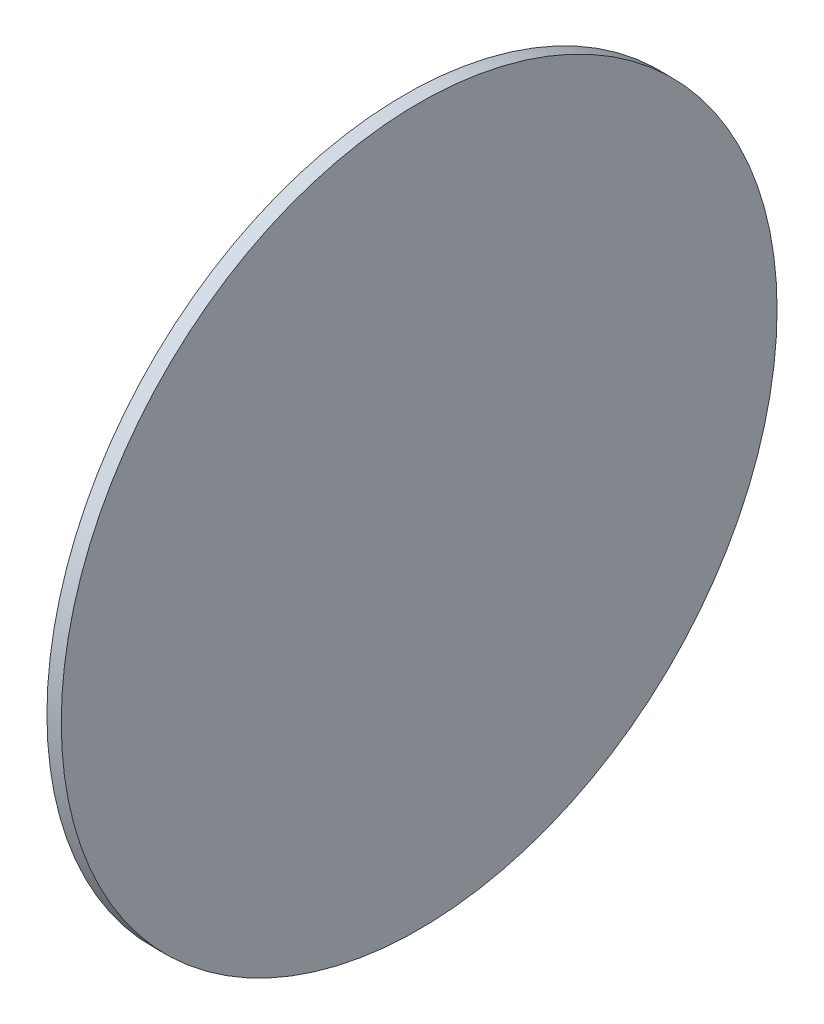
ISO-10303-21;
HEADER;
FILE_DESCRIPTION(('STEP AP214'),'2;1');
FILE_NAME('part.step','',(''),(''),'','','');
FILE_SCHEMA(('AUTOMOTIVE_DESIGN { 1 0 10303 214 1 1 1 1 }'));
ENDSEC;
DATA;
#1=APPLICATION_CONTEXT('core data for automotive mechanical design processes');
#2=APPLICATION_PROTOCOL_DEFINITION('international standard','automotive_design',2000,#1);
#3=PRODUCT_CONTEXT('',#1,'mechanical');
#4=PRODUCT('Part','Part','',(#3));
#5=PRODUCT_RELATED_PRODUCT_CATEGORY('part','',(#4));
#6=PRODUCT_DEFINITION_FORMATION('','',#4);
#7=PRODUCT_DEFINITION_CONTEXT('part definition',#1,'design');
#8=PRODUCT_DEFINITION('design','',#6,#7);
#9=PRODUCT_DEFINITION_SHAPE('','',#8);
#10=(LENGTH_UNIT() NAMED_UNIT(*) SI_UNIT(.MILLI.,.METRE.));
#11=(NAMED_UNIT(*) PLANE_ANGLE_UNIT() SI_UNIT($,.RADIAN.));
#12=(NAMED_UNIT(*) SI_UNIT($,.STERADIAN.) SOLID_ANGLE_UNIT());
#13=UNCERTAINTY_MEASURE_WITH_UNIT(LENGTH_MEASURE(1.E-05),#10,'distance_accuracy_value','');
#14=(GEOMETRIC_REPRESENTATION_CONTEXT(3) GLOBAL_UNCERTAINTY_ASSIGNED_CONTEXT((#13)) GLOBAL_UNIT_ASSIGNED_CONTEXT((#10,
#11,#12)) REPRESENTATION_CONTEXT('',''));
#15=CARTESIAN_POINT('',(0.,0.,0.));
#16=DIRECTION('',(0.,0.,1.));
#17=DIRECTION('',(1.,0.,0.));
#18=AXIS2_PLACEMENT_3D('',#15,#16,#17);
#19=CARTESIAN_POINT('',(10.,0.,0.));
#20=DIRECTION('',(-1.,0.,0.));
#21=DIRECTION('',(0.,0.,1.));
#22=AXIS2_PLACEMENT_3D('',#19,#20,#21);
#23=CYLINDRICAL_SURFACE('',#22,250.);
#24=CARTESIAN_POINT('',(10.,0.,0.));
#25=DIRECTION('',(1.,0.,0.));
#26=DIRECTION('',(0.,0.,-1.));
#27=AXIS2_PLACEMENT_3D('',#24,#25,#26);
#28=CIRCLE('',#27,250.);
#29=CARTESIAN_POINT('',(10.,0.,-250.));
#30=VERTEX_POINT('',#29);
#31=EDGE_CURVE('E10',#30,#30,#28,.T.);
#32=ORIENTED_EDGE('',*,*,#31,.F.);
#33=EDGE_LOOP('',(#32));
#34=FACE_BOUND('',#33,.T.);
#35=CARTESIAN_POINT('',(0.,0.,0.));
#36=DIRECTION('',(1.,0.,0.));
#37=DIRECTION('',(0.,0.,-1.));
#38=AXIS2_PLACEMENT_3D('',#35,#36,#37);
#39=CIRCLE('',#38,250.);
#40=CARTESIAN_POINT('',(0.,0.,-250.));
#41=VERTEX_POINT('',#40);
#42=EDGE_CURVE('E40',#41,#41,#39,.T.);
#43=ORIENTED_EDGE('',*,*,#42,.T.);
#44=EDGE_LOOP('',(#43));
#45=FACE_BOUND('',#44,.T.);
#46=ADVANCED_FACE('F37',(#34,#45),#23,.T.);
#47=CARTESIAN_POINT('',(10.,0.,0.));
#48=DIRECTION('',(1.,0.,0.));
#49=DIRECTION('',(0.,0.,-1.));
#50=AXIS2_PLACEMENT_3D('',#47,#48,#49);
#51=PLANE('',#50);
#52=ORIENTED_EDGE('',*,*,#31,.T.);
#53=EDGE_LOOP('',(#52));
#54=FACE_BOUND('',#53,.T.);
#55=ADVANCED_FACE('F54',(#54),#51,.T.);
#56=CARTESIAN_POINT('',(0.,0.,0.));
#57=DIRECTION('',(1.,0.,0.));
#58=DIRECTION('',(0.,0.,-1.));
#59=AXIS2_PLACEMENT_3D('',#56,#57,#58);
#60=PLANE('',#59);
#61=ORIENTED_EDGE('',*,*,#42,.F.);
#62=EDGE_LOOP('',(#61));
#63=FACE_BOUND('',#62,.T.);
#64=ADVANCED_FACE('F52',(#63),#60,.F.);
#65=CLOSED_SHELL('',(#46,#55,#64));
#66=MANIFOLD_SOLID_BREP('B2',#65);
#67=ADVANCED_BREP_SHAPE_REPRESENTATION('',(#18,#66),#14);
#68=SHAPE_DEFINITION_REPRESENTATION(#9,#67);
ENDSEC;
END-ISO-10303-21;
